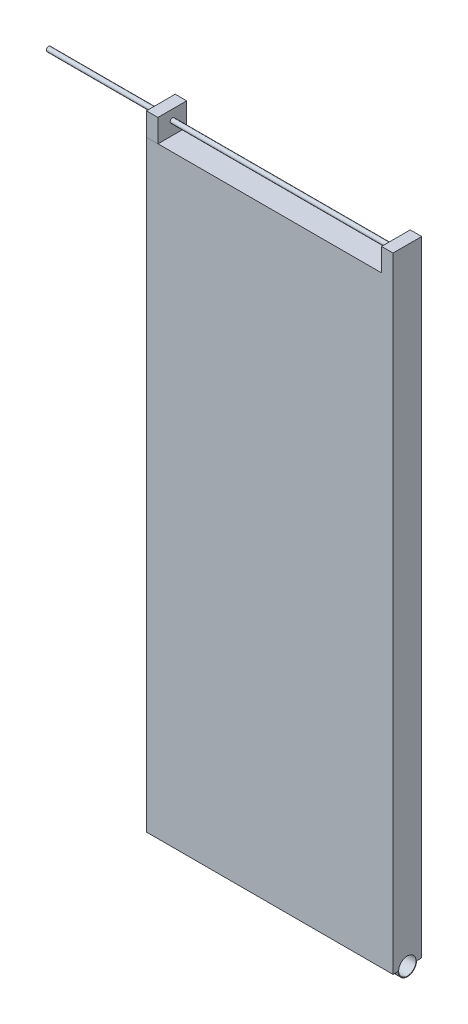
ISO-10303-21;
HEADER;
FILE_DESCRIPTION(('STEP AP214'),'2;1');
FILE_NAME('part.step','',(''),(''),'','','');
FILE_SCHEMA(('AUTOMOTIVE_DESIGN { 1 0 10303 214 1 1 1 1 }'));
ENDSEC;
DATA;
#1=APPLICATION_CONTEXT('core data for automotive mechanical design processes');
#2=APPLICATION_PROTOCOL_DEFINITION('international standard','automotive_design',2000,#1);
#3=PRODUCT_CONTEXT('',#1,'mechanical');
#4=PRODUCT('Part','Part','',(#3));
#5=PRODUCT_RELATED_PRODUCT_CATEGORY('part','',(#4));
#6=PRODUCT_DEFINITION_FORMATION('','',#4);
#7=PRODUCT_DEFINITION_CONTEXT('part definition',#1,'design');
#8=PRODUCT_DEFINITION('design','',#6,#7);
#9=PRODUCT_DEFINITION_SHAPE('','',#8);
#10=(LENGTH_UNIT() NAMED_UNIT(*) SI_UNIT(.MILLI.,.METRE.));
#11=(NAMED_UNIT(*) PLANE_ANGLE_UNIT() SI_UNIT($,.RADIAN.));
#12=(NAMED_UNIT(*) SI_UNIT($,.STERADIAN.) SOLID_ANGLE_UNIT());
#13=UNCERTAINTY_MEASURE_WITH_UNIT(LENGTH_MEASURE(1.E-05),#10,'distance_accuracy_value','');
#14=(GEOMETRIC_REPRESENTATION_CONTEXT(3) GLOBAL_UNCERTAINTY_ASSIGNED_CONTEXT((#13)) GLOBAL_UNIT_ASSIGNED_CONTEXT((#10,
#11,#12)) REPRESENTATION_CONTEXT('',''));
#15=CARTESIAN_POINT('',(0.,0.,0.));
#16=DIRECTION('',(0.,0.,1.));
#17=DIRECTION('',(1.,0.,0.));
#18=AXIS2_PLACEMENT_3D('',#15,#16,#17);
#19=CARTESIAN_POINT('',(107.5,131.25,6.25000000000001));
#20=DIRECTION('',(0.,-1.,0.));
#21=DIRECTION('',(0.,0.,-1.));
#22=AXIS2_PLACEMENT_3D('',#19,#20,#21);
#23=PLANE('',#22);
#24=DIRECTION('',(0.,0.,1.));
#25=VECTOR('',#24,1.);
#26=CARTESIAN_POINT('',(102.5,131.25,-6.25));
#27=LINE('',#26,#25);
#28=CARTESIAN_POINT('',(102.5,131.25,-6.25));
#29=VERTEX_POINT('',#28);
#30=CARTESIAN_POINT('',(102.5,131.25,6.25000000000001));
#31=VERTEX_POINT('',#30);
#32=EDGE_CURVE('E143',#29,#31,#27,.T.);
#33=ORIENTED_EDGE('',*,*,#32,.F.);
#34=DIRECTION('',(-1.,0.,0.));
#35=VECTOR('',#34,1.);
#36=CARTESIAN_POINT('',(107.5,131.25,-6.25000000000001));
#37=LINE('',#36,#35);
#38=CARTESIAN_POINT('',(5.,131.25,-6.25000000000001));
#39=VERTEX_POINT('',#38);
#40=EDGE_CURVE('E147',#29,#39,#37,.T.);
#41=ORIENTED_EDGE('',*,*,#40,.T.);
#42=DIRECTION('',(0.,0.,-1.));
#43=VECTOR('',#42,1.);
#44=CARTESIAN_POINT('',(5.,131.25,-6.25000000000001));
#45=LINE('',#44,#43);
#46=CARTESIAN_POINT('',(5.,131.25,6.25000000000001));
#47=VERTEX_POINT('',#46);
#48=EDGE_CURVE('E44',#47,#39,#45,.T.);
#49=ORIENTED_EDGE('',*,*,#48,.F.);
#50=DIRECTION('',(-1.,0.,0.));
#51=VECTOR('',#50,1.);
#52=CARTESIAN_POINT('',(107.5,131.25,6.25000000000001));
#53=LINE('',#52,#51);
#54=EDGE_CURVE('E52',#31,#47,#53,.T.);
#55=ORIENTED_EDGE('',*,*,#54,.F.);
#56=EDGE_LOOP('',(#33,#41,#49,#55));
#57=FACE_BOUND('',#56,.T.);
#58=ADVANCED_FACE('F35',(#57),#23,.F.);
#59=CARTESIAN_POINT('',(107.5,-131.25,6.25000000000001));
#60=DIRECTION('',(0.,1.,0.));
#61=DIRECTION('',(0.,0.,1.));
#62=AXIS2_PLACEMENT_3D('',#59,#60,#61);
#63=PLANE('',#62);
#64=DIRECTION('',(0.,0.,-1.));
#65=VECTOR('',#64,1.);
#66=CARTESIAN_POINT('',(0.,-131.25,6.25000000000001));
#67=LINE('',#66,#65);
#68=CARTESIAN_POINT('',(0.,-131.25,6.25000000000001));
#69=VERTEX_POINT('',#68);
#70=CARTESIAN_POINT('',(0.,-131.25,4.));
#71=VERTEX_POINT('',#70);
#72=EDGE_CURVE('E194',#69,#71,#67,.T.);
#73=ORIENTED_EDGE('',*,*,#72,.T.);
#74=DIRECTION('',(1.,0.,0.));
#75=VECTOR('',#74,1.);
#76=CARTESIAN_POINT('',(0.,-131.25,4.));
#77=LINE('',#76,#75);
#78=CARTESIAN_POINT('',(107.5,-131.25,4.));
#79=VERTEX_POINT('',#78);
#80=EDGE_CURVE('E187',#71,#79,#77,.T.);
#81=ORIENTED_EDGE('',*,*,#80,.T.);
#82=DIRECTION('',(0.,0.,-1.));
#83=VECTOR('',#82,1.);
#84=CARTESIAN_POINT('',(107.5,-131.25,6.25000000000001));
#85=LINE('',#84,#83);
#86=CARTESIAN_POINT('',(107.5,-131.25,6.25000000000001));
#87=VERTEX_POINT('',#86);
#88=EDGE_CURVE('E197',#87,#79,#85,.T.);
#89=ORIENTED_EDGE('',*,*,#88,.F.);
#90=DIRECTION('',(-1.,0.,0.));
#91=VECTOR('',#90,1.);
#92=CARTESIAN_POINT('',(107.5,-131.25,6.25000000000001));
#93=LINE('',#92,#91);
#94=EDGE_CURVE('E208',#87,#69,#93,.T.);
#95=ORIENTED_EDGE('',*,*,#94,.T.);
#96=EDGE_LOOP('',(#73,#81,#89,#95));
#97=FACE_BOUND('',#96,.T.);
#98=ADVANCED_FACE('F262',(#97),#63,.F.);
#99=CARTESIAN_POINT('',(107.5,-131.25,-6.25000000000001));
#100=DIRECTION('',(0.,0.,1.));
#101=DIRECTION('',(1.,0.,0.));
#102=AXIS2_PLACEMENT_3D('',#99,#100,#101);
#103=PLANE('',#102);
#104=DIRECTION('',(0.,1.,0.));
#105=VECTOR('',#104,1.);
#106=CARTESIAN_POINT('',(0.,-131.25,-6.25000000000001));
#107=LINE('',#106,#105);
#108=CARTESIAN_POINT('',(0.,-131.25,-6.25000000000001));
#109=VERTEX_POINT('',#108);
#110=CARTESIAN_POINT('',(0.,141.25,-6.25000000000001));
#111=VERTEX_POINT('',#110);
#112=EDGE_CURVE('E190',#109,#111,#107,.T.);
#113=ORIENTED_EDGE('',*,*,#112,.T.);
#114=DIRECTION('',(-1.,0.,0.));
#115=VECTOR('',#114,1.);
#116=CARTESIAN_POINT('',(0.,141.25,-6.25000000000001));
#117=LINE('',#116,#115);
#118=CARTESIAN_POINT('',(5.,141.25,-6.25000000000001));
#119=VERTEX_POINT('',#118);
#120=EDGE_CURVE('E163',#119,#111,#117,.T.);
#121=ORIENTED_EDGE('',*,*,#120,.F.);
#122=DIRECTION('',(0.,-1.,0.));
#123=VECTOR('',#122,1.);
#124=CARTESIAN_POINT('',(5.,141.25,-6.25000000000001));
#125=LINE('',#124,#123);
#126=EDGE_CURVE('E165',#119,#39,#125,.T.);
#127=ORIENTED_EDGE('',*,*,#126,.T.);
#128=ORIENTED_EDGE('',*,*,#40,.F.);
#129=DIRECTION('',(0.,-1.,0.));
#130=VECTOR('',#129,1.);
#131=CARTESIAN_POINT('',(102.5,141.25,-6.25));
#132=LINE('',#131,#130);
#133=CARTESIAN_POINT('',(102.5,141.25,-6.25));
#134=VERTEX_POINT('',#133);
#135=EDGE_CURVE('E127',#134,#29,#132,.T.);
#136=ORIENTED_EDGE('',*,*,#135,.F.);
#137=DIRECTION('',(-1.,0.,0.));
#138=VECTOR('',#137,1.);
#139=CARTESIAN_POINT('',(107.5,141.25,-6.25000000000001));
#140=LINE('',#139,#138);
#141=CARTESIAN_POINT('',(107.5,141.25,-6.25000000000001));
#142=VERTEX_POINT('',#141);
#143=EDGE_CURVE('E134',#142,#134,#140,.T.);
#144=ORIENTED_EDGE('',*,*,#143,.F.);
#145=DIRECTION('',(0.,1.,0.));
#146=VECTOR('',#145,1.);
#147=CARTESIAN_POINT('',(107.5,-131.25,-6.25000000000001));
#148=LINE('',#147,#146);
#149=CARTESIAN_POINT('',(107.5,-131.25,-6.25000000000001));
#150=VERTEX_POINT('',#149);
#151=EDGE_CURVE('E191',#150,#142,#148,.T.);
#152=ORIENTED_EDGE('',*,*,#151,.F.);
#153=DIRECTION('',(-1.,0.,0.));
#154=VECTOR('',#153,1.);
#155=CARTESIAN_POINT('',(107.5,-131.25,-6.25000000000001));
#156=LINE('',#155,#154);
#157=EDGE_CURVE('E199',#150,#109,#156,.T.);
#158=ORIENTED_EDGE('',*,*,#157,.T.);
#159=EDGE_LOOP('',(#113,#121,#127,#128,#136,#144,#152,#158));
#160=FACE_BOUND('',#159,.T.);
#161=ADVANCED_FACE('F37',(#160),#103,.F.);
#162=CARTESIAN_POINT('',(107.5,-131.25,6.25000000000001));
#163=DIRECTION('',(0.,0.,-1.));
#164=DIRECTION('',(-1.,0.,0.));
#165=AXIS2_PLACEMENT_3D('',#162,#163,#164);
#166=PLANE('',#165);
#167=DIRECTION('',(0.,-1.,0.));
#168=VECTOR('',#167,1.);
#169=CARTESIAN_POINT('',(0.,-131.25,6.25000000000001));
#170=LINE('',#169,#168);
#171=CARTESIAN_POINT('',(0.,131.25,6.25000000000001));
#172=VERTEX_POINT('',#171);
#173=EDGE_CURVE('E201',#172,#69,#170,.T.);
#174=ORIENTED_EDGE('',*,*,#173,.T.);
#175=ORIENTED_EDGE('',*,*,#94,.F.);
#176=DIRECTION('',(0.,-1.,0.));
#177=VECTOR('',#176,1.);
#178=CARTESIAN_POINT('',(107.5,-131.25,6.25000000000001));
#179=LINE('',#178,#177);
#180=CARTESIAN_POINT('',(107.5,141.25,6.25000000000001));
#181=VERTEX_POINT('',#180);
#182=EDGE_CURVE('E193',#181,#87,#179,.T.);
#183=ORIENTED_EDGE('',*,*,#182,.F.);
#184=DIRECTION('',(1.,0.,0.));
#185=VECTOR('',#184,1.);
#186=CARTESIAN_POINT('',(107.5,141.25,6.25000000000001));
#187=LINE('',#186,#185);
#188=CARTESIAN_POINT('',(102.5,141.25,6.25000000000001));
#189=VERTEX_POINT('',#188);
#190=EDGE_CURVE('E133',#189,#181,#187,.T.);
#191=ORIENTED_EDGE('',*,*,#190,.F.);
#192=DIRECTION('',(0.,-1.,0.));
#193=VECTOR('',#192,1.);
#194=CARTESIAN_POINT('',(102.5,141.25,6.25000000000001));
#195=LINE('',#194,#193);
#196=EDGE_CURVE('E129',#189,#31,#195,.T.);
#197=ORIENTED_EDGE('',*,*,#196,.T.);
#198=ORIENTED_EDGE('',*,*,#54,.T.);
#199=EDGE_CURVE('E211',#47,#172,#53,.T.);
#200=ORIENTED_EDGE('',*,*,#199,.T.);
#201=EDGE_LOOP('',(#174,#175,#183,#191,#197,#198,#200));
#202=FACE_BOUND('',#201,.T.);
#203=ADVANCED_FACE('F272',(#202),#166,.F.);
#204=CARTESIAN_POINT('',(107.5,-131.25,-4.));
#205=VERTEX_POINT('',#204);
#206=EDGE_CURVE('E196',#205,#150,#85,.T.);
#207=ORIENTED_EDGE('',*,*,#206,.F.);
#208=DIRECTION('',(1.,0.,0.));
#209=VECTOR('',#208,1.);
#210=CARTESIAN_POINT('',(0.,-131.25,-4.));
#211=LINE('',#210,#209);
#212=CARTESIAN_POINT('',(0.,-131.25,-4.));
#213=VERTEX_POINT('',#212);
#214=EDGE_CURVE('E183',#205,#213,#211,.F.);
#215=ORIENTED_EDGE('',*,*,#214,.T.);
#216=EDGE_CURVE('E203',#213,#109,#67,.T.);
#217=ORIENTED_EDGE('',*,*,#216,.T.);
#218=ORIENTED_EDGE('',*,*,#157,.F.);
#219=EDGE_LOOP('',(#207,#215,#217,#218));
#220=FACE_BOUND('',#219,.T.);
#221=ADVANCED_FACE('F234',(#220),#63,.F.);
#222=CARTESIAN_POINT('',(107.5,0.,0.));
#223=DIRECTION('',(-1.,0.,0.));
#224=DIRECTION('',(0.,0.,1.));
#225=AXIS2_PLACEMENT_3D('',#222,#223,#224);
#226=PLANE('',#225);
#227=CARTESIAN_POINT('',(107.5,-131.179209747974,0.));
#228=DIRECTION('',(1.,0.,0.));
#229=DIRECTION('',(0.,0.,-1.));
#230=AXIS2_PLACEMENT_3D('',#227,#228,#229);
#231=CIRCLE('',#230,3.8);
#232=CARTESIAN_POINT('',(107.5,-131.179209747974,-3.8));
#233=VERTEX_POINT('',#232);
#234=EDGE_CURVE('E177',#233,#233,#231,.T.);
#235=ORIENTED_EDGE('',*,*,#234,.F.);
#236=EDGE_LOOP('',(#235));
#237=FACE_BOUND('',#236,.T.);
#238=ORIENTED_EDGE('',*,*,#88,.T.);
#239=CARTESIAN_POINT('',(107.5,-131.25,0.));
#240=DIRECTION('',(1.,0.,0.));
#241=DIRECTION('',(0.,0.,-1.));
#242=AXIS2_PLACEMENT_3D('',#239,#240,#241);
#243=CIRCLE('',#242,4.);
#244=EDGE_CURVE('E60',#79,#205,#243,.T.);
#245=ORIENTED_EDGE('',*,*,#244,.T.);
#246=ORIENTED_EDGE('',*,*,#206,.T.);
#247=ORIENTED_EDGE('',*,*,#151,.T.);
#248=DIRECTION('',(0.,0.,-1.));
#249=VECTOR('',#248,1.);
#250=CARTESIAN_POINT('',(107.5,141.25,-6.25000000000001));
#251=LINE('',#250,#249);
#252=EDGE_CURVE('E140',#181,#142,#251,.T.);
#253=ORIENTED_EDGE('',*,*,#252,.F.);
#254=ORIENTED_EDGE('',*,*,#182,.T.);
#255=EDGE_LOOP('',(#238,#245,#246,#247,#253,#254));
#256=FACE_BOUND('',#255,.T.);
#257=ADVANCED_FACE('F223',(#237,#256),#226,.F.);
#258=CARTESIAN_POINT('',(0.,0.,0.));
#259=DIRECTION('',(-1.,0.,0.));
#260=DIRECTION('',(0.,0.,1.));
#261=AXIS2_PLACEMENT_3D('',#258,#259,#260);
#262=PLANE('',#261);
#263=CARTESIAN_POINT('',(0.,136.944722228947,-0.0300000000000066));
#264=DIRECTION('',(-1.,0.,0.));
#265=DIRECTION('',(0.,0.,1.));
#266=AXIS2_PLACEMENT_3D('',#263,#264,#265);
#267=CIRCLE('',#266,1.);
#268=CARTESIAN_POINT('',(0.,136.944722228947,0.969999999999994));
#269=VERTEX_POINT('',#268);
#270=EDGE_CURVE('E11',#269,#269,#267,.T.);
#271=ORIENTED_EDGE('',*,*,#270,.F.);
#272=EDGE_LOOP('',(#271));
#273=FACE_BOUND('',#272,.T.);
#274=CARTESIAN_POINT('',(0.,-131.179209747974,0.));
#275=DIRECTION('',(-1.,0.,0.));
#276=DIRECTION('',(0.,0.,1.));
#277=AXIS2_PLACEMENT_3D('',#274,#275,#276);
#278=CIRCLE('',#277,3.8);
#279=CARTESIAN_POINT('',(0.,-131.179209747974,3.8));
#280=VERTEX_POINT('',#279);
#281=EDGE_CURVE('E180',#280,#280,#278,.T.);
#282=ORIENTED_EDGE('',*,*,#281,.F.);
#283=EDGE_LOOP('',(#282));
#284=FACE_BOUND('',#283,.T.);
#285=ORIENTED_EDGE('',*,*,#216,.F.);
#286=CARTESIAN_POINT('',(0.,-131.25,0.));
#287=DIRECTION('',(1.,0.,0.));
#288=DIRECTION('',(0.,0.,-1.));
#289=AXIS2_PLACEMENT_3D('',#286,#287,#288);
#290=CIRCLE('',#289,4.);
#291=EDGE_CURVE('E181',#71,#213,#290,.T.);
#292=ORIENTED_EDGE('',*,*,#291,.F.);
#293=ORIENTED_EDGE('',*,*,#72,.F.);
#294=ORIENTED_EDGE('',*,*,#173,.F.);
#295=DIRECTION('',(0.,0.,1.));
#296=VECTOR('',#295,1.);
#297=CARTESIAN_POINT('',(0.,131.25,-6.25000000000001));
#298=LINE('',#297,#296);
#299=CARTESIAN_POINT('',(0.,131.25,6.30280166420966));
#300=VERTEX_POINT('',#299);
#301=EDGE_CURVE('E148',#172,#300,#298,.T.);
#302=ORIENTED_EDGE('',*,*,#301,.T.);
#303=DIRECTION('',(0.,-1.,0.));
#304=VECTOR('',#303,1.);
#305=CARTESIAN_POINT('',(0.,141.25,6.30280166420966));
#306=LINE('',#305,#304);
#307=CARTESIAN_POINT('',(0.,141.25,6.30280166420966));
#308=VERTEX_POINT('',#307);
#309=EDGE_CURVE('E174',#308,#300,#306,.T.);
#310=ORIENTED_EDGE('',*,*,#309,.F.);
#311=DIRECTION('',(0.,0.,1.));
#312=VECTOR('',#311,1.);
#313=CARTESIAN_POINT('',(0.,141.25,-6.25000000000001));
#314=LINE('',#313,#312);
#315=EDGE_CURVE('E155',#111,#308,#314,.T.);
#316=ORIENTED_EDGE('',*,*,#315,.F.);
#317=ORIENTED_EDGE('',*,*,#112,.F.);
#318=EDGE_LOOP('',(#285,#292,#293,#294,#302,#310,#316,#317));
#319=FACE_BOUND('',#318,.T.);
#320=ADVANCED_FACE('F219',(#273,#284,#319),#262,.T.);
#321=CARTESIAN_POINT('',(0.,-131.25,0.));
#322=DIRECTION('',(1.,0.,0.));
#323=DIRECTION('',(0.,0.,-1.));
#324=AXIS2_PLACEMENT_3D('',#321,#322,#323);
#325=CYLINDRICAL_SURFACE('',#324,4.);
#326=ORIENTED_EDGE('',*,*,#80,.F.);
#327=ORIENTED_EDGE('',*,*,#291,.T.);
#328=ORIENTED_EDGE('',*,*,#214,.F.);
#329=ORIENTED_EDGE('',*,*,#244,.F.);
#330=EDGE_LOOP('',(#326,#327,#328,#329));
#331=FACE_BOUND('',#330,.T.);
#332=ADVANCED_FACE('F222',(#331),#325,.T.);
#333=CARTESIAN_POINT('',(-1.00000000000007,-131.179209747974,0.));
#334=DIRECTION('',(1.,0.,0.));
#335=DIRECTION('',(0.,0.,-1.));
#336=AXIS2_PLACEMENT_3D('',#333,#334,#335);
#337=CYLINDRICAL_SURFACE('',#336,3.8);
#338=ORIENTED_EDGE('',*,*,#281,.T.);
#339=EDGE_LOOP('',(#338));
#340=FACE_BOUND('',#339,.T.);
#341=ORIENTED_EDGE('',*,*,#234,.T.);
#342=EDGE_LOOP('',(#341));
#343=FACE_BOUND('',#342,.T.);
#344=ADVANCED_FACE('F216',(#340,#343),#337,.F.);
#345=CARTESIAN_POINT('',(0.,141.25,6.30280166420966));
#346=DIRECTION('',(0.,0.,-1.));
#347=DIRECTION('',(-1.,0.,0.));
#348=AXIS2_PLACEMENT_3D('',#345,#346,#347);
#349=PLANE('',#348);
#350=DIRECTION('',(1.,0.,0.));
#351=VECTOR('',#350,1.);
#352=CARTESIAN_POINT('',(0.,131.25,6.30280166420966));
#353=LINE('',#352,#351);
#354=CARTESIAN_POINT('',(5.,131.25,6.30280166420966));
#355=VERTEX_POINT('',#354);
#356=EDGE_CURVE('E150',#300,#355,#353,.T.);
#357=ORIENTED_EDGE('',*,*,#356,.T.);
#358=DIRECTION('',(0.,-1.,0.));
#359=VECTOR('',#358,1.);
#360=CARTESIAN_POINT('',(5.,141.25,6.30280166420966));
#361=LINE('',#360,#359);
#362=CARTESIAN_POINT('',(5.,141.25,6.30280166420966));
#363=VERTEX_POINT('',#362);
#364=EDGE_CURVE('E171',#363,#355,#361,.T.);
#365=ORIENTED_EDGE('',*,*,#364,.F.);
#366=DIRECTION('',(1.,0.,0.));
#367=VECTOR('',#366,1.);
#368=CARTESIAN_POINT('',(0.,141.25,6.30280166420966));
#369=LINE('',#368,#367);
#370=EDGE_CURVE('E158',#308,#363,#369,.T.);
#371=ORIENTED_EDGE('',*,*,#370,.F.);
#372=ORIENTED_EDGE('',*,*,#309,.T.);
#373=EDGE_LOOP('',(#357,#365,#371,#372));
#374=FACE_BOUND('',#373,.T.);
#375=ADVANCED_FACE('F284',(#374),#349,.F.);
#376=CARTESIAN_POINT('',(5.,141.25,-6.25000000000001));
#377=DIRECTION('',(-1.,0.,0.));
#378=DIRECTION('',(0.,0.,1.));
#379=AXIS2_PLACEMENT_3D('',#376,#377,#378);
#380=PLANE('',#379);
#381=CARTESIAN_POINT('',(5.,136.944722228947,-0.0300000000000076));
#382=DIRECTION('',(-1.,0.,0.));
#383=DIRECTION('',(0.,0.,1.));
#384=AXIS2_PLACEMENT_3D('',#381,#382,#383);
#385=CIRCLE('',#384,1.);
#386=CARTESIAN_POINT('',(5.,136.944722228947,0.969999999999993));
#387=VERTEX_POINT('',#386);
#388=EDGE_CURVE('E239',#387,#387,#385,.T.);
#389=ORIENTED_EDGE('',*,*,#388,.T.);
#390=EDGE_LOOP('',(#389));
#391=FACE_BOUND('',#390,.T.);
#392=EDGE_CURVE('E159',#355,#47,#45,.T.);
#393=ORIENTED_EDGE('',*,*,#392,.T.);
#394=ORIENTED_EDGE('',*,*,#48,.T.);
#395=ORIENTED_EDGE('',*,*,#126,.F.);
#396=DIRECTION('',(0.,0.,-1.));
#397=VECTOR('',#396,1.);
#398=CARTESIAN_POINT('',(5.,141.25,-6.25000000000001));
#399=LINE('',#398,#397);
#400=EDGE_CURVE('E161',#363,#119,#399,.T.);
#401=ORIENTED_EDGE('',*,*,#400,.F.);
#402=ORIENTED_EDGE('',*,*,#364,.T.);
#403=EDGE_LOOP('',(#393,#394,#395,#401,#402));
#404=FACE_BOUND('',#403,.T.);
#405=ADVANCED_FACE('F287',(#391,#404),#380,.F.);
#406=CARTESIAN_POINT('',(0.,141.25,0.));
#407=DIRECTION('',(0.,1.,0.));
#408=DIRECTION('',(0.,0.,1.));
#409=AXIS2_PLACEMENT_3D('',#406,#407,#408);
#410=PLANE('',#409);
#411=ORIENTED_EDGE('',*,*,#315,.T.);
#412=ORIENTED_EDGE('',*,*,#370,.T.);
#413=ORIENTED_EDGE('',*,*,#400,.T.);
#414=ORIENTED_EDGE('',*,*,#120,.T.);
#415=EDGE_LOOP('',(#411,#412,#413,#414));
#416=FACE_BOUND('',#415,.T.);
#417=ADVANCED_FACE('F291',(#416),#410,.T.);
#418=CARTESIAN_POINT('',(0.,131.25,0.));
#419=DIRECTION('',(0.,1.,0.));
#420=DIRECTION('',(0.,0.,1.));
#421=AXIS2_PLACEMENT_3D('',#418,#419,#420);
#422=PLANE('',#421);
#423=ORIENTED_EDGE('',*,*,#199,.F.);
#424=ORIENTED_EDGE('',*,*,#392,.F.);
#425=ORIENTED_EDGE('',*,*,#356,.F.);
#426=ORIENTED_EDGE('',*,*,#301,.F.);
#427=EDGE_LOOP('',(#423,#424,#425,#426));
#428=FACE_BOUND('',#427,.T.);
#429=ADVANCED_FACE('F292',(#428),#422,.F.);
#430=CARTESIAN_POINT('',(102.5,141.25,-6.25));
#431=DIRECTION('',(1.,0.,0.));
#432=DIRECTION('',(0.,0.,-1.));
#433=AXIS2_PLACEMENT_3D('',#430,#431,#432);
#434=PLANE('',#433);
#435=CARTESIAN_POINT('',(102.5,136.944722228947,-0.0300000000000278));
#436=DIRECTION('',(1.,0.,0.));
#437=DIRECTION('',(0.,0.,-1.));
#438=AXIS2_PLACEMENT_3D('',#435,#436,#437);
#439=CIRCLE('',#438,1.);
#440=CARTESIAN_POINT('',(102.5,136.944722228947,-1.03000000000003));
#441=VERTEX_POINT('',#440);
#442=EDGE_CURVE('E39',#441,#441,#439,.T.);
#443=ORIENTED_EDGE('',*,*,#442,.T.);
#444=EDGE_LOOP('',(#443));
#445=FACE_BOUND('',#444,.T.);
#446=ORIENTED_EDGE('',*,*,#32,.T.);
#447=ORIENTED_EDGE('',*,*,#196,.F.);
#448=DIRECTION('',(0.,0.,1.));
#449=VECTOR('',#448,1.);
#450=CARTESIAN_POINT('',(102.5,141.25,-6.25));
#451=LINE('',#450,#449);
#452=EDGE_CURVE('E123',#134,#189,#451,.T.);
#453=ORIENTED_EDGE('',*,*,#452,.F.);
#454=ORIENTED_EDGE('',*,*,#135,.T.);
#455=EDGE_LOOP('',(#446,#447,#453,#454));
#456=FACE_BOUND('',#455,.T.);
#457=ADVANCED_FACE('F125',(#445,#456),#434,.F.);
#458=CARTESIAN_POINT('',(0.,141.25,0.));
#459=DIRECTION('',(0.,1.,0.));
#460=DIRECTION('',(0.,0.,1.));
#461=AXIS2_PLACEMENT_3D('',#458,#459,#460);
#462=PLANE('',#461);
#463=ORIENTED_EDGE('',*,*,#143,.T.);
#464=ORIENTED_EDGE('',*,*,#452,.T.);
#465=ORIENTED_EDGE('',*,*,#190,.T.);
#466=ORIENTED_EDGE('',*,*,#252,.T.);
#467=EDGE_LOOP('',(#463,#464,#465,#466));
#468=FACE_BOUND('',#467,.T.);
#469=ADVANCED_FACE('F138',(#468),#462,.T.);
#470=CARTESIAN_POINT('',(-49.,136.944722228947,-0.0299999999999964));
#471=DIRECTION('',(1.,0.,0.));
#472=DIRECTION('',(0.,0.,-1.));
#473=AXIS2_PLACEMENT_3D('',#470,#471,#472);
#474=CYLINDRICAL_SURFACE('',#473,1.);
#475=ORIENTED_EDGE('',*,*,#442,.F.);
#476=EDGE_LOOP('',(#475));
#477=FACE_BOUND('',#476,.T.);
#478=ORIENTED_EDGE('',*,*,#388,.F.);
#479=EDGE_LOOP('',(#478));
#480=FACE_BOUND('',#479,.T.);
#481=ADVANCED_FACE('F258',(#477,#480),#474,.T.);
#482=ORIENTED_EDGE('',*,*,#270,.T.);
#483=EDGE_LOOP('',(#482));
#484=FACE_BOUND('',#483,.T.);
#485=CARTESIAN_POINT('',(-49.,136.944722228947,-0.0299999999999964));
#486=DIRECTION('',(1.,0.,0.));
#487=DIRECTION('',(0.,0.,-1.));
#488=AXIS2_PLACEMENT_3D('',#485,#486,#487);
#489=CIRCLE('',#488,1.);
#490=CARTESIAN_POINT('',(-49.,136.944722228947,-1.03));
#491=VERTEX_POINT('',#490);
#492=EDGE_CURVE('E245',#491,#491,#489,.T.);
#493=ORIENTED_EDGE('',*,*,#492,.T.);
#494=EDGE_LOOP('',(#493));
#495=FACE_BOUND('',#494,.T.);
#496=ADVANCED_FACE('F250',(#484,#495),#474,.T.);
#497=CARTESIAN_POINT('',(-49.,136.944722228947,-0.0299999999999964));
#498=DIRECTION('',(1.,0.,0.));
#499=DIRECTION('',(0.,0.,-1.));
#500=AXIS2_PLACEMENT_3D('',#497,#498,#499);
#501=PLANE('',#500);
#502=ORIENTED_EDGE('',*,*,#492,.F.);
#503=EDGE_LOOP('',(#502));
#504=FACE_BOUND('',#503,.T.);
#505=ADVANCED_FACE('F252',(#504),#501,.F.);
#506=CLOSED_SHELL('',(#58,#98,#161,#203,#221,#257,#320,#332,#344,#375,#405,#417,#429,#457,#469,
#481,#496,#505));
#507=MANIFOLD_SOLID_BREP('B2',#506);
#508=ADVANCED_BREP_SHAPE_REPRESENTATION('',(#18,#507),#14);
#509=SHAPE_DEFINITION_REPRESENTATION(#9,#508);
ENDSEC;
END-ISO-10303-21;
